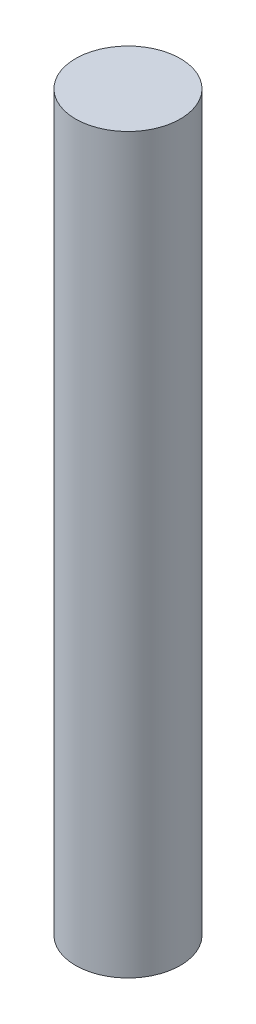
ISO-10303-21;
HEADER;
FILE_DESCRIPTION(('STEP AP214'),'2;1');
FILE_NAME('part.step','',(''),(''),'','','');
FILE_SCHEMA(('AUTOMOTIVE_DESIGN { 1 0 10303 214 1 1 1 1 }'));
ENDSEC;
DATA;
#1=APPLICATION_CONTEXT('core data for automotive mechanical design processes');
#2=APPLICATION_PROTOCOL_DEFINITION('international standard','automotive_design',2000,#1);
#3=PRODUCT_CONTEXT('',#1,'mechanical');
#4=PRODUCT('Part','Part','',(#3));
#5=PRODUCT_RELATED_PRODUCT_CATEGORY('part','',(#4));
#6=PRODUCT_DEFINITION_FORMATION('','',#4);
#7=PRODUCT_DEFINITION_CONTEXT('part definition',#1,'design');
#8=PRODUCT_DEFINITION('design','',#6,#7);
#9=PRODUCT_DEFINITION_SHAPE('','',#8);
#10=(LENGTH_UNIT() NAMED_UNIT(*) SI_UNIT(.MILLI.,.METRE.));
#11=(NAMED_UNIT(*) PLANE_ANGLE_UNIT() SI_UNIT($,.RADIAN.));
#12=(NAMED_UNIT(*) SI_UNIT($,.STERADIAN.) SOLID_ANGLE_UNIT());
#13=UNCERTAINTY_MEASURE_WITH_UNIT(LENGTH_MEASURE(1.E-05),#10,'distance_accuracy_value','');
#14=(GEOMETRIC_REPRESENTATION_CONTEXT(3) GLOBAL_UNCERTAINTY_ASSIGNED_CONTEXT((#13)) GLOBAL_UNIT_ASSIGNED_CONTEXT((#10,
#11,#12)) REPRESENTATION_CONTEXT('',''));
#15=CARTESIAN_POINT('',(0.,0.,0.));
#16=DIRECTION('',(0.,0.,1.));
#17=DIRECTION('',(1.,0.,0.));
#18=AXIS2_PLACEMENT_3D('',#15,#16,#17);
#19=CARTESIAN_POINT('',(0.,4.445,0.));
#20=DIRECTION('',(0.,-1.,0.));
#21=DIRECTION('',(0.,0.,-1.));
#22=AXIS2_PLACEMENT_3D('',#19,#20,#21);
#23=CYLINDRICAL_SURFACE('',#22,0.635);
#24=CARTESIAN_POINT('',(0.,4.445,0.));
#25=DIRECTION('',(0.,1.,0.));
#26=DIRECTION('',(0.,0.,1.));
#27=AXIS2_PLACEMENT_3D('',#24,#25,#26);
#28=CIRCLE('',#27,0.635);
#29=CARTESIAN_POINT('',(0.,4.445,0.635));
#30=VERTEX_POINT('',#29);
#31=EDGE_CURVE('E10',#30,#30,#28,.T.);
#32=ORIENTED_EDGE('',*,*,#31,.F.);
#33=EDGE_LOOP('',(#32));
#34=FACE_BOUND('',#33,.T.);
#35=CARTESIAN_POINT('',(0.,-4.445,0.));
#36=DIRECTION('',(0.,1.,0.));
#37=DIRECTION('',(0.,0.,1.));
#38=AXIS2_PLACEMENT_3D('',#35,#36,#37);
#39=CIRCLE('',#38,0.635);
#40=CARTESIAN_POINT('',(0.,-4.445,0.635));
#41=VERTEX_POINT('',#40);
#42=EDGE_CURVE('E36',#41,#41,#39,.T.);
#43=ORIENTED_EDGE('',*,*,#42,.T.);
#44=EDGE_LOOP('',(#43));
#45=FACE_BOUND('',#44,.T.);
#46=ADVANCED_FACE('F33',(#34,#45),#23,.T.);
#47=CARTESIAN_POINT('',(0.,4.445,0.));
#48=DIRECTION('',(0.,1.,0.));
#49=DIRECTION('',(0.,0.,1.));
#50=AXIS2_PLACEMENT_3D('',#47,#48,#49);
#51=PLANE('',#50);
#52=ORIENTED_EDGE('',*,*,#31,.T.);
#53=EDGE_LOOP('',(#52));
#54=FACE_BOUND('',#53,.T.);
#55=ADVANCED_FACE('F48',(#54),#51,.T.);
#56=CARTESIAN_POINT('',(0.,-4.445,0.));
#57=DIRECTION('',(0.,1.,0.));
#58=DIRECTION('',(0.,0.,1.));
#59=AXIS2_PLACEMENT_3D('',#56,#57,#58);
#60=PLANE('',#59);
#61=ORIENTED_EDGE('',*,*,#42,.F.);
#62=EDGE_LOOP('',(#61));
#63=FACE_BOUND('',#62,.T.);
#64=ADVANCED_FACE('F46',(#63),#60,.F.);
#65=CLOSED_SHELL('',(#46,#55,#64));
#66=MANIFOLD_SOLID_BREP('B2',#65);
#67=ADVANCED_BREP_SHAPE_REPRESENTATION('',(#18,#66),#14);
#68=SHAPE_DEFINITION_REPRESENTATION(#9,#67);
ENDSEC;
END-ISO-10303-21;
